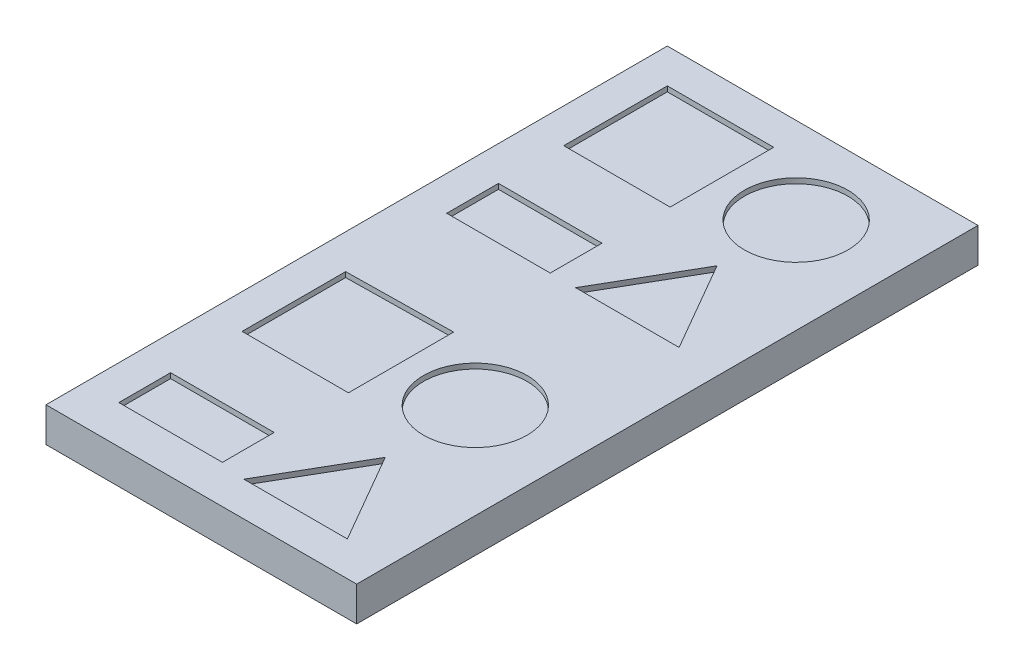
ISO-10303-21;
HEADER;
FILE_DESCRIPTION(('STEP AP214'),'2;1');
FILE_NAME('part.step','',(''),(''),'','','');
FILE_SCHEMA(('AUTOMOTIVE_DESIGN { 1 0 10303 214 1 1 1 1 }'));
ENDSEC;
DATA;
#1=APPLICATION_CONTEXT('core data for automotive mechanical design processes');
#2=APPLICATION_PROTOCOL_DEFINITION('international standard','automotive_design',2000,#1);
#3=PRODUCT_CONTEXT('',#1,'mechanical');
#4=PRODUCT('Part','Part','',(#3));
#5=PRODUCT_RELATED_PRODUCT_CATEGORY('part','',(#4));
#6=PRODUCT_DEFINITION_FORMATION('','',#4);
#7=PRODUCT_DEFINITION_CONTEXT('part definition',#1,'design');
#8=PRODUCT_DEFINITION('design','',#6,#7);
#9=PRODUCT_DEFINITION_SHAPE('','',#8);
#10=(LENGTH_UNIT() NAMED_UNIT(*) SI_UNIT(.MILLI.,.METRE.));
#11=(NAMED_UNIT(*) PLANE_ANGLE_UNIT() SI_UNIT($,.RADIAN.));
#12=(NAMED_UNIT(*) SI_UNIT($,.STERADIAN.) SOLID_ANGLE_UNIT());
#13=UNCERTAINTY_MEASURE_WITH_UNIT(LENGTH_MEASURE(1.E-05),#10,'distance_accuracy_value','');
#14=(GEOMETRIC_REPRESENTATION_CONTEXT(3) GLOBAL_UNCERTAINTY_ASSIGNED_CONTEXT((#13)) GLOBAL_UNIT_ASSIGNED_CONTEXT((#10,
#11,#12)) REPRESENTATION_CONTEXT('',''));
#15=CARTESIAN_POINT('',(0.,0.,0.));
#16=DIRECTION('',(0.,0.,1.));
#17=DIRECTION('',(1.,0.,0.));
#18=AXIS2_PLACEMENT_3D('',#15,#16,#17);
#19=CARTESIAN_POINT('',(90.,-20.,-180.));
#20=DIRECTION('',(1.,0.,0.));
#21=DIRECTION('',(0.,0.,-1.));
#22=AXIS2_PLACEMENT_3D('',#19,#20,#21);
#23=PLANE('',#22);
#24=DIRECTION('',(0.,0.,-1.));
#25=VECTOR('',#24,1.);
#26=CARTESIAN_POINT('',(90.,0.,-180.));
#27=LINE('',#26,#25);
#28=CARTESIAN_POINT('',(90.,0.,180.));
#29=VERTEX_POINT('',#28);
#30=CARTESIAN_POINT('',(90.,0.,-180.));
#31=VERTEX_POINT('',#30);
#32=EDGE_CURVE('E393',#29,#31,#27,.T.);
#33=ORIENTED_EDGE('',*,*,#32,.F.);
#34=DIRECTION('',(0.,1.,0.));
#35=VECTOR('',#34,1.);
#36=CARTESIAN_POINT('',(90.,-20.,180.));
#37=LINE('',#36,#35);
#38=CARTESIAN_POINT('',(90.,-20.,180.));
#39=VERTEX_POINT('',#38);
#40=EDGE_CURVE('E11',#39,#29,#37,.T.);
#41=ORIENTED_EDGE('',*,*,#40,.F.);
#42=DIRECTION('',(0.,0.,-1.));
#43=VECTOR('',#42,1.);
#44=CARTESIAN_POINT('',(90.,-20.,-180.));
#45=LINE('',#44,#43);
#46=CARTESIAN_POINT('',(90.,-20.,-180.));
#47=VERTEX_POINT('',#46);
#48=EDGE_CURVE('E400',#39,#47,#45,.T.);
#49=ORIENTED_EDGE('',*,*,#48,.T.);
#50=DIRECTION('',(0.,1.,0.));
#51=VECTOR('',#50,1.);
#52=CARTESIAN_POINT('',(90.,-20.,-180.));
#53=LINE('',#52,#51);
#54=EDGE_CURVE('E38',#47,#31,#53,.T.);
#55=ORIENTED_EDGE('',*,*,#54,.T.);
#56=EDGE_LOOP('',(#33,#41,#49,#55));
#57=FACE_BOUND('',#56,.T.);
#58=ADVANCED_FACE('F35',(#57),#23,.T.);
#59=CARTESIAN_POINT('',(-90.,-20.,180.));
#60=DIRECTION('',(0.,0.,1.));
#61=DIRECTION('',(1.,0.,0.));
#62=AXIS2_PLACEMENT_3D('',#59,#60,#61);
#63=PLANE('',#62);
#64=DIRECTION('',(1.,0.,0.));
#65=VECTOR('',#64,1.);
#66=CARTESIAN_POINT('',(-90.,0.,180.));
#67=LINE('',#66,#65);
#68=CARTESIAN_POINT('',(-90.,0.,180.));
#69=VERTEX_POINT('',#68);
#70=EDGE_CURVE('E404',#69,#29,#67,.T.);
#71=ORIENTED_EDGE('',*,*,#70,.F.);
#72=DIRECTION('',(0.,1.,0.));
#73=VECTOR('',#72,1.);
#74=CARTESIAN_POINT('',(-90.,-20.,180.));
#75=LINE('',#74,#73);
#76=CARTESIAN_POINT('',(-90.,-20.,180.));
#77=VERTEX_POINT('',#76);
#78=EDGE_CURVE('E43',#77,#69,#75,.T.);
#79=ORIENTED_EDGE('',*,*,#78,.F.);
#80=DIRECTION('',(1.,0.,0.));
#81=VECTOR('',#80,1.);
#82=CARTESIAN_POINT('',(-90.,-20.,180.));
#83=LINE('',#82,#81);
#84=EDGE_CURVE('E410',#77,#39,#83,.T.);
#85=ORIENTED_EDGE('',*,*,#84,.T.);
#86=ORIENTED_EDGE('',*,*,#40,.T.);
#87=EDGE_LOOP('',(#71,#79,#85,#86));
#88=FACE_BOUND('',#87,.T.);
#89=ADVANCED_FACE('F436',(#88),#63,.T.);
#90=CARTESIAN_POINT('',(-90.,-20.,-180.));
#91=DIRECTION('',(-1.,0.,0.));
#92=DIRECTION('',(0.,0.,1.));
#93=AXIS2_PLACEMENT_3D('',#90,#91,#92);
#94=PLANE('',#93);
#95=DIRECTION('',(0.,0.,1.));
#96=VECTOR('',#95,1.);
#97=CARTESIAN_POINT('',(-90.,0.,-180.));
#98=LINE('',#97,#96);
#99=CARTESIAN_POINT('',(-90.,0.,-180.));
#100=VERTEX_POINT('',#99);
#101=EDGE_CURVE('E418',#100,#69,#98,.T.);
#102=ORIENTED_EDGE('',*,*,#101,.F.);
#103=DIRECTION('',(0.,1.,0.));
#104=VECTOR('',#103,1.);
#105=CARTESIAN_POINT('',(-90.,-20.,-180.));
#106=LINE('',#105,#104);
#107=CARTESIAN_POINT('',(-90.,-20.,-180.));
#108=VERTEX_POINT('',#107);
#109=EDGE_CURVE('E423',#108,#100,#106,.T.);
#110=ORIENTED_EDGE('',*,*,#109,.F.);
#111=DIRECTION('',(0.,0.,1.));
#112=VECTOR('',#111,1.);
#113=CARTESIAN_POINT('',(-90.,-20.,-180.));
#114=LINE('',#113,#112);
#115=EDGE_CURVE('E407',#108,#77,#114,.T.);
#116=ORIENTED_EDGE('',*,*,#115,.T.);
#117=ORIENTED_EDGE('',*,*,#78,.T.);
#118=EDGE_LOOP('',(#102,#110,#116,#117));
#119=FACE_BOUND('',#118,.T.);
#120=ADVANCED_FACE('F442',(#119),#94,.T.);
#121=CARTESIAN_POINT('',(-90.,-20.,-180.));
#122=DIRECTION('',(0.,0.,-1.));
#123=DIRECTION('',(-1.,0.,0.));
#124=AXIS2_PLACEMENT_3D('',#121,#122,#123);
#125=PLANE('',#124);
#126=DIRECTION('',(-1.,0.,0.));
#127=VECTOR('',#126,1.);
#128=CARTESIAN_POINT('',(-90.,0.,-180.));
#129=LINE('',#128,#127);
#130=EDGE_CURVE('E415',#31,#100,#129,.T.);
#131=ORIENTED_EDGE('',*,*,#130,.F.);
#132=ORIENTED_EDGE('',*,*,#54,.F.);
#133=DIRECTION('',(-1.,0.,0.));
#134=VECTOR('',#133,1.);
#135=CARTESIAN_POINT('',(-90.,-20.,-180.));
#136=LINE('',#135,#134);
#137=EDGE_CURVE('E403',#47,#108,#136,.T.);
#138=ORIENTED_EDGE('',*,*,#137,.T.);
#139=ORIENTED_EDGE('',*,*,#109,.T.);
#140=EDGE_LOOP('',(#131,#132,#138,#139));
#141=FACE_BOUND('',#140,.T.);
#142=ADVANCED_FACE('F431',(#141),#125,.T.);
#143=CARTESIAN_POINT('',(0.,-20.,0.));
#144=DIRECTION('',(0.,1.,0.));
#145=DIRECTION('',(0.,0.,1.));
#146=AXIS2_PLACEMENT_3D('',#143,#144,#145);
#147=PLANE('',#146);
#148=ORIENTED_EDGE('',*,*,#48,.F.);
#149=ORIENTED_EDGE('',*,*,#84,.F.);
#150=ORIENTED_EDGE('',*,*,#115,.F.);
#151=ORIENTED_EDGE('',*,*,#137,.F.);
#152=EDGE_LOOP('',(#148,#149,#150,#151));
#153=FACE_BOUND('',#152,.T.);
#154=ADVANCED_FACE('F439',(#153),#147,.F.);
#155=CARTESIAN_POINT('',(0.,0.,0.));
#156=DIRECTION('',(0.,1.,0.));
#157=DIRECTION('',(0.,0.,1.));
#158=AXIS2_PLACEMENT_3D('',#155,#156,#157);
#159=PLANE('',#158);
#160=CARTESIAN_POINT('',(34.6561708111627,0.,-130.));
#161=DIRECTION('',(0.,1.,0.));
#162=DIRECTION('',(0.,0.,1.));
#163=AXIS2_PLACEMENT_3D('',#160,#161,#162);
#164=CIRCLE('',#163,30.);
#165=CARTESIAN_POINT('',(34.6561708111627,0.,-100.));
#166=VERTEX_POINT('',#165);
#167=EDGE_CURVE('E280',#166,#166,#164,.T.);
#168=ORIENTED_EDGE('',*,*,#167,.F.);
#169=EDGE_LOOP('',(#168));
#170=FACE_BOUND('',#169,.T.);
#171=DIRECTION('',(-0.499999999999999,0.,0.866025403784439));
#172=VECTOR('',#171,1.);
#173=CARTESIAN_POINT('',(34.6561708111627,0.,-84.1237165561634));
#174=LINE('',#173,#172);
#175=CARTESIAN_POINT('',(34.6561708111627,0.,-84.1237165561634));
#176=VERTEX_POINT('',#175);
#177=CARTESIAN_POINT('',(4.65617081116275,0.,-32.162192329097));
#178=VERTEX_POINT('',#177);
#179=EDGE_CURVE('E51',#176,#178,#174,.T.);
#180=ORIENTED_EDGE('',*,*,#179,.F.);
#181=DIRECTION('',(-0.5,0.,-0.866025403784439));
#182=VECTOR('',#181,1.);
#183=CARTESIAN_POINT('',(64.6561708111627,0.,-32.1621923290971));
#184=LINE('',#183,#182);
#185=CARTESIAN_POINT('',(64.6561708111627,0.,-32.1621923290971));
#186=VERTEX_POINT('',#185);
#187=EDGE_CURVE('E288',#186,#176,#184,.T.);
#188=ORIENTED_EDGE('',*,*,#187,.F.);
#189=DIRECTION('',(1.,0.,0.));
#190=VECTOR('',#189,1.);
#191=CARTESIAN_POINT('',(4.65617081116275,0.,-32.162192329097));
#192=LINE('',#191,#190);
#193=EDGE_CURVE('E296',#178,#186,#192,.T.);
#194=ORIENTED_EDGE('',*,*,#193,.F.);
#195=EDGE_LOOP('',(#180,#188,#194));
#196=FACE_BOUND('',#195,.T.);
#197=DIRECTION('',(0.,0.,1.));
#198=VECTOR('',#197,1.);
#199=CARTESIAN_POINT('',(-70.,0.,26.3874416264153));
#200=LINE('',#199,#198);
#201=CARTESIAN_POINT('',(-70.,0.,26.3874416264153));
#202=VERTEX_POINT('',#201);
#203=CARTESIAN_POINT('',(-70.,0.,86.3874416264154));
#204=VERTEX_POINT('',#203);
#205=EDGE_CURVE('E59',#202,#204,#200,.T.);
#206=ORIENTED_EDGE('',*,*,#205,.F.);
#207=DIRECTION('',(-0.999882207760636,0.,0.0153483094742156));
#208=VECTOR('',#207,1.);
#209=CARTESIAN_POINT('',(-70.,0.,26.3874416264153));
#210=LINE('',#209,#208);
#211=CARTESIAN_POINT('',(-8.37534543890204,0.,25.4414959319083));
#212=VERTEX_POINT('',#211);
#213=EDGE_CURVE('E310',#212,#202,#210,.T.);
#214=ORIENTED_EDGE('',*,*,#213,.F.);
#215=DIRECTION('',(0.,0.,-1.));
#216=VECTOR('',#215,1.);
#217=CARTESIAN_POINT('',(-8.37534543890204,0.,25.4414959319083));
#218=LINE('',#217,#216);
#219=CARTESIAN_POINT('',(-8.37534543890203,0.,86.3874416264154));
#220=VERTEX_POINT('',#219);
#221=EDGE_CURVE('E325',#220,#212,#218,.T.);
#222=ORIENTED_EDGE('',*,*,#221,.F.);
#223=DIRECTION('',(1.,0.,0.));
#224=VECTOR('',#223,1.);
#225=CARTESIAN_POINT('',(-70.,0.,86.3874416264154));
#226=LINE('',#225,#224);
#227=EDGE_CURVE('E321',#204,#220,#226,.T.);
#228=ORIENTED_EDGE('',*,*,#227,.F.);
#229=EDGE_LOOP('',(#206,#214,#222,#228));
#230=FACE_BOUND('',#229,.T.);
#231=DIRECTION('',(0.,0.,1.));
#232=VECTOR('',#231,1.);
#233=CARTESIAN_POINT('',(-70.,0.,-32.162192329097));
#234=LINE('',#233,#232);
#235=CARTESIAN_POINT('',(-70.,0.,-62.162192329097));
#236=VERTEX_POINT('',#235);
#237=CARTESIAN_POINT('',(-70.,0.,-32.162192329097));
#238=VERTEX_POINT('',#237);
#239=EDGE_CURVE('E350',#236,#238,#234,.T.);
#240=ORIENTED_EDGE('',*,*,#239,.F.);
#241=DIRECTION('',(-1.,0.,0.));
#242=VECTOR('',#241,1.);
#243=CARTESIAN_POINT('',(-70.,0.,-62.162192329097));
#244=LINE('',#243,#242);
#245=CARTESIAN_POINT('',(-10.,0.,-62.162192329097));
#246=VERTEX_POINT('',#245);
#247=EDGE_CURVE('E340',#246,#236,#244,.T.);
#248=ORIENTED_EDGE('',*,*,#247,.F.);
#249=DIRECTION('',(0.,0.,-1.));
#250=VECTOR('',#249,1.);
#251=CARTESIAN_POINT('',(-10.,0.,-32.162192329097));
#252=LINE('',#251,#250);
#253=CARTESIAN_POINT('',(-10.,0.,-32.162192329097));
#254=VERTEX_POINT('',#253);
#255=EDGE_CURVE('E356',#254,#246,#252,.T.);
#256=ORIENTED_EDGE('',*,*,#255,.F.);
#257=DIRECTION('',(1.,0.,0.));
#258=VECTOR('',#257,1.);
#259=CARTESIAN_POINT('',(-70.,0.,-32.162192329097));
#260=LINE('',#259,#258);
#261=EDGE_CURVE('E352',#238,#254,#260,.T.);
#262=ORIENTED_EDGE('',*,*,#261,.F.);
#263=EDGE_LOOP('',(#240,#248,#256,#262));
#264=FACE_BOUND('',#263,.T.);
#265=CARTESIAN_POINT('',(34.6561708111628,0.,55.9144687791618));
#266=DIRECTION('',(0.,1.,0.));
#267=DIRECTION('',(0.,0.,1.));
#268=AXIS2_PLACEMENT_3D('',#265,#266,#267);
#269=CIRCLE('',#268,30.);
#270=CARTESIAN_POINT('',(34.6561708111628,0.,85.9144687791618));
#271=VERTEX_POINT('',#270);
#272=EDGE_CURVE('E235',#271,#271,#269,.T.);
#273=ORIENTED_EDGE('',*,*,#272,.F.);
#274=EDGE_LOOP('',(#273));
#275=FACE_BOUND('',#274,.T.);
#276=DIRECTION('',(-0.5,0.,0.866025403784438));
#277=VECTOR('',#276,1.);
#278=CARTESIAN_POINT('',(34.6561708111628,0.,108.078586506608));
#279=LINE('',#278,#277);
#280=CARTESIAN_POINT('',(34.6561708111628,0.,108.078586506608));
#281=VERTEX_POINT('',#280);
#282=CARTESIAN_POINT('',(4.65617081116277,0.,160.040110733674));
#283=VERTEX_POINT('',#282);
#284=EDGE_CURVE('E215',#281,#283,#279,.T.);
#285=ORIENTED_EDGE('',*,*,#284,.F.);
#286=DIRECTION('',(-0.5,0.,-0.866025403784439));
#287=VECTOR('',#286,1.);
#288=CARTESIAN_POINT('',(64.6561708111628,0.,160.040110733674));
#289=LINE('',#288,#287);
#290=CARTESIAN_POINT('',(64.6561708111628,0.,160.040110733674));
#291=VERTEX_POINT('',#290);
#292=EDGE_CURVE('E229',#291,#281,#289,.T.);
#293=ORIENTED_EDGE('',*,*,#292,.F.);
#294=DIRECTION('',(1.,0.,0.));
#295=VECTOR('',#294,1.);
#296=CARTESIAN_POINT('',(4.65617081116277,0.,160.040110733674));
#297=LINE('',#296,#295);
#298=EDGE_CURVE('E232',#283,#291,#297,.T.);
#299=ORIENTED_EDGE('',*,*,#298,.F.);
#300=EDGE_LOOP('',(#285,#293,#299));
#301=FACE_BOUND('',#300,.T.);
#302=DIRECTION('',(0.,0.,1.));
#303=VECTOR('',#302,1.);
#304=CARTESIAN_POINT('',(-70.,0.,157.801384824244));
#305=LINE('',#304,#303);
#306=CARTESIAN_POINT('',(-70.,0.,127.801384824244));
#307=VERTEX_POINT('',#306);
#308=CARTESIAN_POINT('',(-70.,0.,157.801384824244));
#309=VERTEX_POINT('',#308);
#310=EDGE_CURVE('E259',#307,#309,#305,.T.);
#311=ORIENTED_EDGE('',*,*,#310,.F.);
#312=DIRECTION('',(-1.,0.,0.));
#313=VECTOR('',#312,1.);
#314=CARTESIAN_POINT('',(-70.,0.,127.801384824244));
#315=LINE('',#314,#313);
#316=CARTESIAN_POINT('',(-10.,0.,127.801384824244));
#317=VERTEX_POINT('',#316);
#318=EDGE_CURVE('E249',#317,#307,#315,.T.);
#319=ORIENTED_EDGE('',*,*,#318,.F.);
#320=DIRECTION('',(0.,0.,-1.));
#321=VECTOR('',#320,1.);
#322=CARTESIAN_POINT('',(-10.,0.,157.801384824244));
#323=LINE('',#322,#321);
#324=CARTESIAN_POINT('',(-10.,0.,157.801384824244));
#325=VERTEX_POINT('',#324);
#326=EDGE_CURVE('E264',#325,#317,#323,.T.);
#327=ORIENTED_EDGE('',*,*,#326,.F.);
#328=DIRECTION('',(1.,0.,0.));
#329=VECTOR('',#328,1.);
#330=CARTESIAN_POINT('',(-70.,0.,157.801384824244));
#331=LINE('',#330,#329);
#332=EDGE_CURVE('E261',#309,#325,#331,.T.);
#333=ORIENTED_EDGE('',*,*,#332,.F.);
#334=EDGE_LOOP('',(#311,#319,#327,#333));
#335=FACE_BOUND('',#334,.T.);
#336=DIRECTION('',(0.,0.,1.));
#337=VECTOR('',#336,1.);
#338=CARTESIAN_POINT('',(-70.,0.,-160.));
#339=LINE('',#338,#337);
#340=CARTESIAN_POINT('',(-70.,0.,-160.));
#341=VERTEX_POINT('',#340);
#342=CARTESIAN_POINT('',(-70.,0.,-99.9999999999999));
#343=VERTEX_POINT('',#342);
#344=EDGE_CURVE('E279',#341,#343,#339,.T.);
#345=ORIENTED_EDGE('',*,*,#344,.F.);
#346=DIRECTION('',(-1.,0.,0.));
#347=VECTOR('',#346,1.);
#348=CARTESIAN_POINT('',(-70.,0.,-160.));
#349=LINE('',#348,#347);
#350=CARTESIAN_POINT('',(-8.37534543890203,0.,-160.));
#351=VERTEX_POINT('',#350);
#352=EDGE_CURVE('E372',#351,#341,#349,.T.);
#353=ORIENTED_EDGE('',*,*,#352,.F.);
#354=DIRECTION('',(0.,0.,-1.));
#355=VECTOR('',#354,1.);
#356=CARTESIAN_POINT('',(-8.37534543890203,0.,-160.));
#357=LINE('',#356,#355);
#358=CARTESIAN_POINT('',(-8.37534543890202,0.,-99.9999999999999));
#359=VERTEX_POINT('',#358);
#360=EDGE_CURVE('E386',#359,#351,#357,.T.);
#361=ORIENTED_EDGE('',*,*,#360,.F.);
#362=DIRECTION('',(1.,0.,0.));
#363=VECTOR('',#362,1.);
#364=CARTESIAN_POINT('',(-70.,0.,-99.9999999999999));
#365=LINE('',#364,#363);
#366=EDGE_CURVE('E383',#343,#359,#365,.T.);
#367=ORIENTED_EDGE('',*,*,#366,.F.);
#368=EDGE_LOOP('',(#345,#353,#361,#367));
#369=FACE_BOUND('',#368,.T.);
#370=ORIENTED_EDGE('',*,*,#32,.T.);
#371=ORIENTED_EDGE('',*,*,#130,.T.);
#372=ORIENTED_EDGE('',*,*,#101,.T.);
#373=ORIENTED_EDGE('',*,*,#70,.T.);
#374=EDGE_LOOP('',(#370,#371,#372,#373));
#375=FACE_BOUND('',#374,.T.);
#376=ADVANCED_FACE('F433',(#170,#196,#230,#264,#275,#301,#335,#369,#375),#159,.T.);
#377=CARTESIAN_POINT('',(-70.,-3.,-160.));
#378=DIRECTION('',(-1.,0.,0.));
#379=DIRECTION('',(0.,0.,1.));
#380=AXIS2_PLACEMENT_3D('',#377,#378,#379);
#381=PLANE('',#380);
#382=ORIENTED_EDGE('',*,*,#344,.T.);
#383=DIRECTION('',(0.,1.,0.));
#384=VECTOR('',#383,1.);
#385=CARTESIAN_POINT('',(-70.,-3.,-99.9999999999999));
#386=LINE('',#385,#384);
#387=CARTESIAN_POINT('',(-70.,-3.,-99.9999999999999));
#388=VERTEX_POINT('',#387);
#389=EDGE_CURVE('E381',#388,#343,#386,.T.);
#390=ORIENTED_EDGE('',*,*,#389,.F.);
#391=DIRECTION('',(0.,0.,1.));
#392=VECTOR('',#391,1.);
#393=CARTESIAN_POINT('',(-70.,-3.,-160.));
#394=LINE('',#393,#392);
#395=CARTESIAN_POINT('',(-70.,-3.,-160.));
#396=VERTEX_POINT('',#395);
#397=EDGE_CURVE('E368',#396,#388,#394,.T.);
#398=ORIENTED_EDGE('',*,*,#397,.F.);
#399=DIRECTION('',(0.,1.,0.));
#400=VECTOR('',#399,1.);
#401=CARTESIAN_POINT('',(-70.,-3.,-160.));
#402=LINE('',#401,#400);
#403=EDGE_CURVE('E391',#396,#341,#402,.T.);
#404=ORIENTED_EDGE('',*,*,#403,.T.);
#405=EDGE_LOOP('',(#382,#390,#398,#404));
#406=FACE_BOUND('',#405,.T.);
#407=ADVANCED_FACE('F492',(#406),#381,.F.);
#408=CARTESIAN_POINT('',(-70.,-3.,-160.));
#409=DIRECTION('',(0.,0.,-1.));
#410=DIRECTION('',(-1.,0.,0.));
#411=AXIS2_PLACEMENT_3D('',#408,#409,#410);
#412=PLANE('',#411);
#413=ORIENTED_EDGE('',*,*,#352,.T.);
#414=ORIENTED_EDGE('',*,*,#403,.F.);
#415=DIRECTION('',(-1.,0.,0.));
#416=VECTOR('',#415,1.);
#417=CARTESIAN_POINT('',(-70.,-3.,-160.));
#418=LINE('',#417,#416);
#419=CARTESIAN_POINT('',(-8.37534543890203,-3.,-160.));
#420=VERTEX_POINT('',#419);
#421=EDGE_CURVE('E378',#420,#396,#418,.T.);
#422=ORIENTED_EDGE('',*,*,#421,.F.);
#423=DIRECTION('',(0.,1.,0.));
#424=VECTOR('',#423,1.);
#425=CARTESIAN_POINT('',(-8.37534543890203,-3.,-160.));
#426=LINE('',#425,#424);
#427=EDGE_CURVE('E394',#420,#351,#426,.T.);
#428=ORIENTED_EDGE('',*,*,#427,.T.);
#429=EDGE_LOOP('',(#413,#414,#422,#428));
#430=FACE_BOUND('',#429,.T.);
#431=ADVANCED_FACE('F499',(#430),#412,.F.);
#432=CARTESIAN_POINT('',(-8.37534543890203,-3.,-160.));
#433=DIRECTION('',(1.,0.,0.));
#434=DIRECTION('',(0.,0.,-1.));
#435=AXIS2_PLACEMENT_3D('',#432,#433,#434);
#436=PLANE('',#435);
#437=ORIENTED_EDGE('',*,*,#360,.T.);
#438=ORIENTED_EDGE('',*,*,#427,.F.);
#439=DIRECTION('',(0.,0.,-1.));
#440=VECTOR('',#439,1.);
#441=CARTESIAN_POINT('',(-8.37534543890203,-3.,-160.));
#442=LINE('',#441,#440);
#443=CARTESIAN_POINT('',(-8.37534543890202,-3.,-99.9999999999999));
#444=VERTEX_POINT('',#443);
#445=EDGE_CURVE('E375',#444,#420,#442,.T.);
#446=ORIENTED_EDGE('',*,*,#445,.F.);
#447=DIRECTION('',(0.,1.,0.));
#448=VECTOR('',#447,1.);
#449=CARTESIAN_POINT('',(-8.37534543890202,-3.,-99.9999999999999));
#450=LINE('',#449,#448);
#451=EDGE_CURVE('E396',#444,#359,#450,.T.);
#452=ORIENTED_EDGE('',*,*,#451,.T.);
#453=EDGE_LOOP('',(#437,#438,#446,#452));
#454=FACE_BOUND('',#453,.T.);
#455=ADVANCED_FACE('F507',(#454),#436,.F.);
#456=CARTESIAN_POINT('',(-70.,-3.,-99.9999999999999));
#457=DIRECTION('',(0.,0.,1.));
#458=DIRECTION('',(1.,0.,0.));
#459=AXIS2_PLACEMENT_3D('',#456,#457,#458);
#460=PLANE('',#459);
#461=ORIENTED_EDGE('',*,*,#366,.T.);
#462=ORIENTED_EDGE('',*,*,#451,.F.);
#463=DIRECTION('',(1.,0.,0.));
#464=VECTOR('',#463,1.);
#465=CARTESIAN_POINT('',(-70.,-3.,-99.9999999999999));
#466=LINE('',#465,#464);
#467=EDGE_CURVE('E371',#388,#444,#466,.T.);
#468=ORIENTED_EDGE('',*,*,#467,.F.);
#469=ORIENTED_EDGE('',*,*,#389,.T.);
#470=EDGE_LOOP('',(#461,#462,#468,#469));
#471=FACE_BOUND('',#470,.T.);
#472=ADVANCED_FACE('F515',(#471),#460,.F.);
#473=CARTESIAN_POINT('',(0.,-3.,0.));
#474=DIRECTION('',(0.,1.,0.));
#475=DIRECTION('',(0.,0.,1.));
#476=AXIS2_PLACEMENT_3D('',#473,#474,#475);
#477=PLANE('',#476);
#478=ORIENTED_EDGE('',*,*,#397,.T.);
#479=ORIENTED_EDGE('',*,*,#467,.T.);
#480=ORIENTED_EDGE('',*,*,#445,.T.);
#481=ORIENTED_EDGE('',*,*,#421,.T.);
#482=EDGE_LOOP('',(#478,#479,#480,#481));
#483=FACE_BOUND('',#482,.T.);
#484=ADVANCED_FACE('F523',(#483),#477,.T.);
#485=CARTESIAN_POINT('',(-70.,-3.,157.801384824244));
#486=DIRECTION('',(-1.,0.,0.));
#487=DIRECTION('',(0.,0.,1.));
#488=AXIS2_PLACEMENT_3D('',#485,#486,#487);
#489=PLANE('',#488);
#490=ORIENTED_EDGE('',*,*,#310,.T.);
#491=DIRECTION('',(0.,1.,0.));
#492=VECTOR('',#491,1.);
#493=CARTESIAN_POINT('',(-70.,-3.,157.801384824244));
#494=LINE('',#493,#492);
#495=CARTESIAN_POINT('',(-70.,-3.,157.801384824244));
#496=VERTEX_POINT('',#495);
#497=EDGE_CURVE('E258',#496,#309,#494,.T.);
#498=ORIENTED_EDGE('',*,*,#497,.F.);
#499=DIRECTION('',(0.,0.,1.));
#500=VECTOR('',#499,1.);
#501=CARTESIAN_POINT('',(-70.,-3.,157.801384824244));
#502=LINE('',#501,#500);
#503=CARTESIAN_POINT('',(-70.,-3.,127.801384824244));
#504=VERTEX_POINT('',#503);
#505=EDGE_CURVE('E245',#504,#496,#502,.T.);
#506=ORIENTED_EDGE('',*,*,#505,.F.);
#507=DIRECTION('',(0.,1.,0.));
#508=VECTOR('',#507,1.);
#509=CARTESIAN_POINT('',(-70.,-3.,127.801384824244));
#510=LINE('',#509,#508);
#511=EDGE_CURVE('E240',#504,#307,#510,.T.);
#512=ORIENTED_EDGE('',*,*,#511,.T.);
#513=EDGE_LOOP('',(#490,#498,#506,#512));
#514=FACE_BOUND('',#513,.T.);
#515=ADVANCED_FACE('F531',(#514),#489,.F.);
#516=CARTESIAN_POINT('',(-70.,-3.,127.801384824244));
#517=DIRECTION('',(0.,0.,-1.));
#518=DIRECTION('',(-1.,0.,0.));
#519=AXIS2_PLACEMENT_3D('',#516,#517,#518);
#520=PLANE('',#519);
#521=ORIENTED_EDGE('',*,*,#318,.T.);
#522=ORIENTED_EDGE('',*,*,#511,.F.);
#523=DIRECTION('',(-1.,0.,0.));
#524=VECTOR('',#523,1.);
#525=CARTESIAN_POINT('',(-70.,-3.,127.801384824244));
#526=LINE('',#525,#524);
#527=CARTESIAN_POINT('',(-10.,-3.,127.801384824244));
#528=VERTEX_POINT('',#527);
#529=EDGE_CURVE('E255',#528,#504,#526,.T.);
#530=ORIENTED_EDGE('',*,*,#529,.F.);
#531=DIRECTION('',(0.,1.,0.));
#532=VECTOR('',#531,1.);
#533=CARTESIAN_POINT('',(-10.,-3.,127.801384824244));
#534=LINE('',#533,#532);
#535=EDGE_CURVE('E270',#528,#317,#534,.T.);
#536=ORIENTED_EDGE('',*,*,#535,.T.);
#537=EDGE_LOOP('',(#521,#522,#530,#536));
#538=FACE_BOUND('',#537,.T.);
#539=ADVANCED_FACE('F539',(#538),#520,.F.);
#540=CARTESIAN_POINT('',(-10.,-3.,157.801384824244));
#541=DIRECTION('',(1.,0.,0.));
#542=DIRECTION('',(0.,0.,-1.));
#543=AXIS2_PLACEMENT_3D('',#540,#541,#542);
#544=PLANE('',#543);
#545=ORIENTED_EDGE('',*,*,#326,.T.);
#546=ORIENTED_EDGE('',*,*,#535,.F.);
#547=DIRECTION('',(0.,0.,-1.));
#548=VECTOR('',#547,1.);
#549=CARTESIAN_POINT('',(-10.,-3.,157.801384824244));
#550=LINE('',#549,#548);
#551=CARTESIAN_POINT('',(-10.,-3.,157.801384824244));
#552=VERTEX_POINT('',#551);
#553=EDGE_CURVE('E252',#552,#528,#550,.T.);
#554=ORIENTED_EDGE('',*,*,#553,.F.);
#555=DIRECTION('',(0.,1.,0.));
#556=VECTOR('',#555,1.);
#557=CARTESIAN_POINT('',(-10.,-3.,157.801384824244));
#558=LINE('',#557,#556);
#559=EDGE_CURVE('E272',#552,#325,#558,.T.);
#560=ORIENTED_EDGE('',*,*,#559,.T.);
#561=EDGE_LOOP('',(#545,#546,#554,#560));
#562=FACE_BOUND('',#561,.T.);
#563=ADVANCED_FACE('F547',(#562),#544,.F.);
#564=CARTESIAN_POINT('',(-70.,-3.,157.801384824244));
#565=DIRECTION('',(0.,0.,1.));
#566=DIRECTION('',(1.,0.,0.));
#567=AXIS2_PLACEMENT_3D('',#564,#565,#566);
#568=PLANE('',#567);
#569=ORIENTED_EDGE('',*,*,#332,.T.);
#570=ORIENTED_EDGE('',*,*,#559,.F.);
#571=DIRECTION('',(1.,0.,0.));
#572=VECTOR('',#571,1.);
#573=CARTESIAN_POINT('',(-70.,-3.,157.801384824244));
#574=LINE('',#573,#572);
#575=EDGE_CURVE('E248',#496,#552,#574,.T.);
#576=ORIENTED_EDGE('',*,*,#575,.F.);
#577=ORIENTED_EDGE('',*,*,#497,.T.);
#578=EDGE_LOOP('',(#569,#570,#576,#577));
#579=FACE_BOUND('',#578,.T.);
#580=ADVANCED_FACE('F555',(#579),#568,.F.);
#581=CARTESIAN_POINT('',(0.,-3.,0.));
#582=DIRECTION('',(0.,-1.,0.));
#583=DIRECTION('',(0.,0.,-1.));
#584=AXIS2_PLACEMENT_3D('',#581,#582,#583);
#585=PLANE('',#584);
#586=ORIENTED_EDGE('',*,*,#505,.T.);
#587=ORIENTED_EDGE('',*,*,#575,.T.);
#588=ORIENTED_EDGE('',*,*,#553,.T.);
#589=ORIENTED_EDGE('',*,*,#529,.T.);
#590=EDGE_LOOP('',(#586,#587,#588,#589));
#591=FACE_BOUND('',#590,.T.);
#592=ADVANCED_FACE('F563',(#591),#585,.F.);
#593=CARTESIAN_POINT('',(34.6561708111628,-3.,108.078586506608));
#594=DIRECTION('',(-0.866025403784439,0.,-0.5));
#595=DIRECTION('',(-0.5,0.,0.866025403784439));
#596=AXIS2_PLACEMENT_3D('',#593,#594,#595);
#597=PLANE('',#596);
#598=ORIENTED_EDGE('',*,*,#284,.T.);
#599=DIRECTION('',(0.,1.,0.));
#600=VECTOR('',#599,1.);
#601=CARTESIAN_POINT('',(4.65617081116277,-3.,160.040110733674));
#602=LINE('',#601,#600);
#603=CARTESIAN_POINT('',(4.65617081116277,-3.,160.040110733674));
#604=VERTEX_POINT('',#603);
#605=EDGE_CURVE('E208',#604,#283,#602,.T.);
#606=ORIENTED_EDGE('',*,*,#605,.F.);
#607=DIRECTION('',(-0.5,0.,0.866025403784438));
#608=VECTOR('',#607,1.);
#609=CARTESIAN_POINT('',(34.6561708111628,-3.,108.078586506608));
#610=LINE('',#609,#608);
#611=CARTESIAN_POINT('',(34.6561708111628,-3.,108.078586506608));
#612=VERTEX_POINT('',#611);
#613=EDGE_CURVE('E212',#612,#604,#610,.T.);
#614=ORIENTED_EDGE('',*,*,#613,.F.);
#615=DIRECTION('',(0.,1.,0.));
#616=VECTOR('',#615,1.);
#617=CARTESIAN_POINT('',(34.6561708111628,-3.,108.078586506608));
#618=LINE('',#617,#616);
#619=EDGE_CURVE('E242',#612,#281,#618,.T.);
#620=ORIENTED_EDGE('',*,*,#619,.T.);
#621=EDGE_LOOP('',(#598,#606,#614,#620));
#622=FACE_BOUND('',#621,.T.);
#623=ADVANCED_FACE('F210',(#622),#597,.F.);
#624=CARTESIAN_POINT('',(64.6561708111628,-3.,160.040110733674));
#625=DIRECTION('',(0.866025403784439,0.,-0.5));
#626=DIRECTION('',(-0.5,0.,-0.866025403784439));
#627=AXIS2_PLACEMENT_3D('',#624,#625,#626);
#628=PLANE('',#627);
#629=ORIENTED_EDGE('',*,*,#292,.T.);
#630=ORIENTED_EDGE('',*,*,#619,.F.);
#631=DIRECTION('',(-0.5,0.,-0.866025403784439));
#632=VECTOR('',#631,1.);
#633=CARTESIAN_POINT('',(64.6561708111628,-3.,160.040110733674));
#634=LINE('',#633,#632);
#635=CARTESIAN_POINT('',(64.6561708111628,-3.,160.040110733674));
#636=VERTEX_POINT('',#635);
#637=EDGE_CURVE('E220',#636,#612,#634,.T.);
#638=ORIENTED_EDGE('',*,*,#637,.F.);
#639=DIRECTION('',(0.,1.,0.));
#640=VECTOR('',#639,1.);
#641=CARTESIAN_POINT('',(64.6561708111628,-3.,160.040110733674));
#642=LINE('',#641,#640);
#643=EDGE_CURVE('E219',#636,#291,#642,.T.);
#644=ORIENTED_EDGE('',*,*,#643,.T.);
#645=EDGE_LOOP('',(#629,#630,#638,#644));
#646=FACE_BOUND('',#645,.T.);
#647=ADVANCED_FACE('F578',(#646),#628,.F.);
#648=CARTESIAN_POINT('',(4.65617081116277,-3.,160.040110733674));
#649=DIRECTION('',(0.,0.,1.));
#650=DIRECTION('',(1.,0.,0.));
#651=AXIS2_PLACEMENT_3D('',#648,#649,#650);
#652=PLANE('',#651);
#653=ORIENTED_EDGE('',*,*,#298,.T.);
#654=ORIENTED_EDGE('',*,*,#643,.F.);
#655=DIRECTION('',(1.,0.,0.));
#656=VECTOR('',#655,1.);
#657=CARTESIAN_POINT('',(4.65617081116277,-3.,160.040110733674));
#658=LINE('',#657,#656);
#659=EDGE_CURVE('E223',#604,#636,#658,.T.);
#660=ORIENTED_EDGE('',*,*,#659,.F.);
#661=ORIENTED_EDGE('',*,*,#605,.T.);
#662=EDGE_LOOP('',(#653,#654,#660,#661));
#663=FACE_BOUND('',#662,.T.);
#664=ADVANCED_FACE('F224',(#663),#652,.F.);
#665=CARTESIAN_POINT('',(0.,-3.,0.));
#666=DIRECTION('',(0.,1.,0.));
#667=DIRECTION('',(0.,0.,1.));
#668=AXIS2_PLACEMENT_3D('',#665,#666,#667);
#669=PLANE('',#668);
#670=ORIENTED_EDGE('',*,*,#613,.T.);
#671=ORIENTED_EDGE('',*,*,#659,.T.);
#672=ORIENTED_EDGE('',*,*,#637,.T.);
#673=EDGE_LOOP('',(#670,#671,#672));
#674=FACE_BOUND('',#673,.T.);
#675=ADVANCED_FACE('F228',(#674),#669,.T.);
#676=CARTESIAN_POINT('',(34.6561708111628,-3.,55.9144687791618));
#677=DIRECTION('',(0.,1.,0.));
#678=DIRECTION('',(0.,0.,1.));
#679=AXIS2_PLACEMENT_3D('',#676,#677,#678);
#680=CYLINDRICAL_SURFACE('',#679,30.);
#681=CARTESIAN_POINT('',(34.6561708111628,-3.,55.9144687791618));
#682=DIRECTION('',(0.,1.,0.));
#683=DIRECTION('',(0.,0.,1.));
#684=AXIS2_PLACEMENT_3D('',#681,#682,#683);
#685=CIRCLE('',#684,30.);
#686=CARTESIAN_POINT('',(34.6561708111628,-3.,85.9144687791618));
#687=VERTEX_POINT('',#686);
#688=EDGE_CURVE('E353',#687,#687,#685,.T.);
#689=ORIENTED_EDGE('',*,*,#688,.F.);
#690=EDGE_LOOP('',(#689));
#691=FACE_BOUND('',#690,.T.);
#692=ORIENTED_EDGE('',*,*,#272,.T.);
#693=EDGE_LOOP('',(#692));
#694=FACE_BOUND('',#693,.T.);
#695=ADVANCED_FACE('F598',(#691,#694),#680,.F.);
#696=CARTESIAN_POINT('',(34.6561708111628,-3.,55.9144687791618));
#697=DIRECTION('',(0.,1.,0.));
#698=DIRECTION('',(0.,0.,1.));
#699=AXIS2_PLACEMENT_3D('',#696,#697,#698);
#700=PLANE('',#699);
#701=ORIENTED_EDGE('',*,*,#688,.T.);
#702=EDGE_LOOP('',(#701));
#703=FACE_BOUND('',#702,.T.);
#704=ADVANCED_FACE('F605',(#703),#700,.T.);
#705=CARTESIAN_POINT('',(-70.,-3.,-32.162192329097));
#706=DIRECTION('',(-1.,0.,0.));
#707=DIRECTION('',(0.,0.,1.));
#708=AXIS2_PLACEMENT_3D('',#705,#706,#707);
#709=PLANE('',#708);
#710=ORIENTED_EDGE('',*,*,#239,.T.);
#711=DIRECTION('',(0.,1.,0.));
#712=VECTOR('',#711,1.);
#713=CARTESIAN_POINT('',(-70.,-3.,-32.162192329097));
#714=LINE('',#713,#712);
#715=CARTESIAN_POINT('',(-70.,-3.,-32.162192329097));
#716=VERTEX_POINT('',#715);
#717=EDGE_CURVE('E349',#716,#238,#714,.T.);
#718=ORIENTED_EDGE('',*,*,#717,.F.);
#719=DIRECTION('',(0.,0.,1.));
#720=VECTOR('',#719,1.);
#721=CARTESIAN_POINT('',(-70.,-3.,-32.162192329097));
#722=LINE('',#721,#720);
#723=CARTESIAN_POINT('',(-70.,-3.,-62.162192329097));
#724=VERTEX_POINT('',#723);
#725=EDGE_CURVE('E336',#724,#716,#722,.T.);
#726=ORIENTED_EDGE('',*,*,#725,.F.);
#727=DIRECTION('',(0.,1.,0.));
#728=VECTOR('',#727,1.);
#729=CARTESIAN_POINT('',(-70.,-3.,-62.162192329097));
#730=LINE('',#729,#728);
#731=EDGE_CURVE('E322',#724,#236,#730,.T.);
#732=ORIENTED_EDGE('',*,*,#731,.T.);
#733=EDGE_LOOP('',(#710,#718,#726,#732));
#734=FACE_BOUND('',#733,.T.);
#735=ADVANCED_FACE('F613',(#734),#709,.F.);
#736=CARTESIAN_POINT('',(-70.,-3.,-62.162192329097));
#737=DIRECTION('',(0.,0.,-1.));
#738=DIRECTION('',(-1.,0.,0.));
#739=AXIS2_PLACEMENT_3D('',#736,#737,#738);
#740=PLANE('',#739);
#741=ORIENTED_EDGE('',*,*,#247,.T.);
#742=ORIENTED_EDGE('',*,*,#731,.F.);
#743=DIRECTION('',(-1.,0.,0.));
#744=VECTOR('',#743,1.);
#745=CARTESIAN_POINT('',(-70.,-3.,-62.162192329097));
#746=LINE('',#745,#744);
#747=CARTESIAN_POINT('',(-10.,-3.,-62.162192329097));
#748=VERTEX_POINT('',#747);
#749=EDGE_CURVE('E346',#748,#724,#746,.T.);
#750=ORIENTED_EDGE('',*,*,#749,.F.);
#751=DIRECTION('',(0.,1.,0.));
#752=VECTOR('',#751,1.);
#753=CARTESIAN_POINT('',(-10.,-3.,-62.162192329097));
#754=LINE('',#753,#752);
#755=EDGE_CURVE('E362',#748,#246,#754,.T.);
#756=ORIENTED_EDGE('',*,*,#755,.T.);
#757=EDGE_LOOP('',(#741,#742,#750,#756));
#758=FACE_BOUND('',#757,.T.);
#759=ADVANCED_FACE('F621',(#758),#740,.F.);
#760=CARTESIAN_POINT('',(-10.,-3.,-32.162192329097));
#761=DIRECTION('',(1.,0.,0.));
#762=DIRECTION('',(0.,0.,-1.));
#763=AXIS2_PLACEMENT_3D('',#760,#761,#762);
#764=PLANE('',#763);
#765=ORIENTED_EDGE('',*,*,#255,.T.);
#766=ORIENTED_EDGE('',*,*,#755,.F.);
#767=DIRECTION('',(0.,0.,-1.));
#768=VECTOR('',#767,1.);
#769=CARTESIAN_POINT('',(-10.,-3.,-32.162192329097));
#770=LINE('',#769,#768);
#771=CARTESIAN_POINT('',(-10.,-3.,-32.162192329097));
#772=VERTEX_POINT('',#771);
#773=EDGE_CURVE('E343',#772,#748,#770,.T.);
#774=ORIENTED_EDGE('',*,*,#773,.F.);
#775=DIRECTION('',(0.,1.,0.));
#776=VECTOR('',#775,1.);
#777=CARTESIAN_POINT('',(-10.,-3.,-32.162192329097));
#778=LINE('',#777,#776);
#779=EDGE_CURVE('E364',#772,#254,#778,.T.);
#780=ORIENTED_EDGE('',*,*,#779,.T.);
#781=EDGE_LOOP('',(#765,#766,#774,#780));
#782=FACE_BOUND('',#781,.T.);
#783=ADVANCED_FACE('F629',(#782),#764,.F.);
#784=CARTESIAN_POINT('',(-70.,-3.,-32.162192329097));
#785=DIRECTION('',(0.,0.,1.));
#786=DIRECTION('',(1.,0.,0.));
#787=AXIS2_PLACEMENT_3D('',#784,#785,#786);
#788=PLANE('',#787);
#789=ORIENTED_EDGE('',*,*,#261,.T.);
#790=ORIENTED_EDGE('',*,*,#779,.F.);
#791=DIRECTION('',(1.,0.,0.));
#792=VECTOR('',#791,1.);
#793=CARTESIAN_POINT('',(-70.,-3.,-32.162192329097));
#794=LINE('',#793,#792);
#795=EDGE_CURVE('E339',#716,#772,#794,.T.);
#796=ORIENTED_EDGE('',*,*,#795,.F.);
#797=ORIENTED_EDGE('',*,*,#717,.T.);
#798=EDGE_LOOP('',(#789,#790,#796,#797));
#799=FACE_BOUND('',#798,.T.);
#800=ADVANCED_FACE('F637',(#799),#788,.F.);
#801=CARTESIAN_POINT('',(0.,-3.,0.));
#802=DIRECTION('',(0.,-1.,0.));
#803=DIRECTION('',(0.,0.,-1.));
#804=AXIS2_PLACEMENT_3D('',#801,#802,#803);
#805=PLANE('',#804);
#806=ORIENTED_EDGE('',*,*,#725,.T.);
#807=ORIENTED_EDGE('',*,*,#795,.T.);
#808=ORIENTED_EDGE('',*,*,#773,.T.);
#809=ORIENTED_EDGE('',*,*,#749,.T.);
#810=EDGE_LOOP('',(#806,#807,#808,#809));
#811=FACE_BOUND('',#810,.T.);
#812=ADVANCED_FACE('F645',(#811),#805,.F.);
#813=CARTESIAN_POINT('',(-70.,-3.,26.3874416264153));
#814=DIRECTION('',(-1.,0.,0.));
#815=DIRECTION('',(0.,0.,1.));
#816=AXIS2_PLACEMENT_3D('',#813,#814,#815);
#817=PLANE('',#816);
#818=ORIENTED_EDGE('',*,*,#205,.T.);
#819=DIRECTION('',(0.,1.,0.));
#820=VECTOR('',#819,1.);
#821=CARTESIAN_POINT('',(-70.,-3.,86.3874416264154));
#822=LINE('',#821,#820);
#823=CARTESIAN_POINT('',(-70.,-3.,86.3874416264154));
#824=VERTEX_POINT('',#823);
#825=EDGE_CURVE('E319',#824,#204,#822,.T.);
#826=ORIENTED_EDGE('',*,*,#825,.F.);
#827=DIRECTION('',(0.,0.,1.));
#828=VECTOR('',#827,1.);
#829=CARTESIAN_POINT('',(-70.,-3.,26.3874416264153));
#830=LINE('',#829,#828);
#831=CARTESIAN_POINT('',(-70.,-3.,26.3874416264153));
#832=VERTEX_POINT('',#831);
#833=EDGE_CURVE('E306',#832,#824,#830,.T.);
#834=ORIENTED_EDGE('',*,*,#833,.F.);
#835=DIRECTION('',(0.,1.,0.));
#836=VECTOR('',#835,1.);
#837=CARTESIAN_POINT('',(-70.,-3.,26.3874416264153));
#838=LINE('',#837,#836);
#839=EDGE_CURVE('E297',#832,#202,#838,.T.);
#840=ORIENTED_EDGE('',*,*,#839,.T.);
#841=EDGE_LOOP('',(#818,#826,#834,#840));
#842=FACE_BOUND('',#841,.T.);
#843=ADVANCED_FACE('F653',(#842),#817,.F.);
#844=CARTESIAN_POINT('',(-70.,-3.,26.3874416264153));
#845=DIRECTION('',(-0.0153483094742156,0.,-0.999882207760636));
#846=DIRECTION('',(-0.999882207760636,0.,0.0153483094742156));
#847=AXIS2_PLACEMENT_3D('',#844,#845,#846);
#848=PLANE('',#847);
#849=ORIENTED_EDGE('',*,*,#213,.T.);
#850=ORIENTED_EDGE('',*,*,#839,.F.);
#851=DIRECTION('',(-0.999882207760636,0.,0.0153483094742156));
#852=VECTOR('',#851,1.);
#853=CARTESIAN_POINT('',(-70.,-3.,26.3874416264153));
#854=LINE('',#853,#852);
#855=CARTESIAN_POINT('',(-8.37534543890204,-3.,25.4414959319083));
#856=VERTEX_POINT('',#855);
#857=EDGE_CURVE('E316',#856,#832,#854,.T.);
#858=ORIENTED_EDGE('',*,*,#857,.F.);
#859=DIRECTION('',(0.,1.,0.));
#860=VECTOR('',#859,1.);
#861=CARTESIAN_POINT('',(-8.37534543890204,-3.,25.4414959319083));
#862=LINE('',#861,#860);
#863=EDGE_CURVE('E331',#856,#212,#862,.T.);
#864=ORIENTED_EDGE('',*,*,#863,.T.);
#865=EDGE_LOOP('',(#849,#850,#858,#864));
#866=FACE_BOUND('',#865,.T.);
#867=ADVANCED_FACE('F661',(#866),#848,.F.);
#868=CARTESIAN_POINT('',(-8.37534543890204,-3.,25.4414959319083));
#869=DIRECTION('',(1.,0.,0.));
#870=DIRECTION('',(0.,0.,-1.));
#871=AXIS2_PLACEMENT_3D('',#868,#869,#870);
#872=PLANE('',#871);
#873=ORIENTED_EDGE('',*,*,#221,.T.);
#874=ORIENTED_EDGE('',*,*,#863,.F.);
#875=DIRECTION('',(0.,0.,-1.));
#876=VECTOR('',#875,1.);
#877=CARTESIAN_POINT('',(-8.37534543890204,-3.,25.4414959319083));
#878=LINE('',#877,#876);
#879=CARTESIAN_POINT('',(-8.37534543890203,-3.,86.3874416264154));
#880=VERTEX_POINT('',#879);
#881=EDGE_CURVE('E313',#880,#856,#878,.T.);
#882=ORIENTED_EDGE('',*,*,#881,.F.);
#883=DIRECTION('',(0.,1.,0.));
#884=VECTOR('',#883,1.);
#885=CARTESIAN_POINT('',(-8.37534543890203,-3.,86.3874416264154));
#886=LINE('',#885,#884);
#887=EDGE_CURVE('E333',#880,#220,#886,.T.);
#888=ORIENTED_EDGE('',*,*,#887,.T.);
#889=EDGE_LOOP('',(#873,#874,#882,#888));
#890=FACE_BOUND('',#889,.T.);
#891=ADVANCED_FACE('F668',(#890),#872,.F.);
#892=CARTESIAN_POINT('',(-70.,-3.,86.3874416264154));
#893=DIRECTION('',(0.,0.,1.));
#894=DIRECTION('',(1.,0.,0.));
#895=AXIS2_PLACEMENT_3D('',#892,#893,#894);
#896=PLANE('',#895);
#897=ORIENTED_EDGE('',*,*,#227,.T.);
#898=ORIENTED_EDGE('',*,*,#887,.F.);
#899=DIRECTION('',(1.,0.,0.));
#900=VECTOR('',#899,1.);
#901=CARTESIAN_POINT('',(-70.,-3.,86.3874416264154));
#902=LINE('',#901,#900);
#903=EDGE_CURVE('E309',#824,#880,#902,.T.);
#904=ORIENTED_EDGE('',*,*,#903,.F.);
#905=ORIENTED_EDGE('',*,*,#825,.T.);
#906=EDGE_LOOP('',(#897,#898,#904,#905));
#907=FACE_BOUND('',#906,.T.);
#908=ADVANCED_FACE('F676',(#907),#896,.F.);
#909=CARTESIAN_POINT('',(0.,-3.,0.));
#910=DIRECTION('',(0.,1.,0.));
#911=DIRECTION('',(0.,0.,1.));
#912=AXIS2_PLACEMENT_3D('',#909,#910,#911);
#913=PLANE('',#912);
#914=ORIENTED_EDGE('',*,*,#833,.T.);
#915=ORIENTED_EDGE('',*,*,#903,.T.);
#916=ORIENTED_EDGE('',*,*,#881,.T.);
#917=ORIENTED_EDGE('',*,*,#857,.T.);
#918=EDGE_LOOP('',(#914,#915,#916,#917));
#919=FACE_BOUND('',#918,.T.);
#920=ADVANCED_FACE('F684',(#919),#913,.T.);
#921=CARTESIAN_POINT('',(34.6561708111627,-3.,-84.1237165561634));
#922=DIRECTION('',(-0.866025403784439,0.,-0.499999999999999));
#923=DIRECTION('',(-0.499999999999999,0.,0.866025403784439));
#924=AXIS2_PLACEMENT_3D('',#921,#922,#923);
#925=PLANE('',#924);
#926=ORIENTED_EDGE('',*,*,#179,.T.);
#927=DIRECTION('',(0.,1.,0.));
#928=VECTOR('',#927,1.);
#929=CARTESIAN_POINT('',(4.65617081116275,-3.,-32.162192329097));
#930=LINE('',#929,#928);
#931=CARTESIAN_POINT('',(4.65617081116275,-3.,-32.162192329097));
#932=VERTEX_POINT('',#931);
#933=EDGE_CURVE('E294',#932,#178,#930,.T.);
#934=ORIENTED_EDGE('',*,*,#933,.F.);
#935=DIRECTION('',(-0.499999999999999,0.,0.866025403784439));
#936=VECTOR('',#935,1.);
#937=CARTESIAN_POINT('',(34.6561708111627,-3.,-84.1237165561634));
#938=LINE('',#937,#936);
#939=CARTESIAN_POINT('',(34.6561708111627,-3.,-84.1237165561634));
#940=VERTEX_POINT('',#939);
#941=EDGE_CURVE('E284',#940,#932,#938,.T.);
#942=ORIENTED_EDGE('',*,*,#941,.F.);
#943=DIRECTION('',(0.,1.,0.));
#944=VECTOR('',#943,1.);
#945=CARTESIAN_POINT('',(34.6561708111627,-3.,-84.1237165561634));
#946=LINE('',#945,#944);
#947=EDGE_CURVE('E283',#940,#176,#946,.T.);
#948=ORIENTED_EDGE('',*,*,#947,.T.);
#949=EDGE_LOOP('',(#926,#934,#942,#948));
#950=FACE_BOUND('',#949,.T.);
#951=ADVANCED_FACE('F692',(#950),#925,.F.);
#952=CARTESIAN_POINT('',(64.6561708111627,-3.,-32.1621923290971));
#953=DIRECTION('',(0.866025403784439,0.,-0.5));
#954=DIRECTION('',(-0.5,0.,-0.866025403784439));
#955=AXIS2_PLACEMENT_3D('',#952,#953,#954);
#956=PLANE('',#955);
#957=ORIENTED_EDGE('',*,*,#187,.T.);
#958=ORIENTED_EDGE('',*,*,#947,.F.);
#959=DIRECTION('',(-0.5,0.,-0.866025403784439));
#960=VECTOR('',#959,1.);
#961=CARTESIAN_POINT('',(64.6561708111627,-3.,-32.1621923290971));
#962=LINE('',#961,#960);
#963=CARTESIAN_POINT('',(64.6561708111627,-3.,-32.1621923290971));
#964=VERTEX_POINT('',#963);
#965=EDGE_CURVE('E291',#964,#940,#962,.T.);
#966=ORIENTED_EDGE('',*,*,#965,.F.);
#967=DIRECTION('',(0.,1.,0.));
#968=VECTOR('',#967,1.);
#969=CARTESIAN_POINT('',(64.6561708111627,-3.,-32.1621923290971));
#970=LINE('',#969,#968);
#971=EDGE_CURVE('E303',#964,#186,#970,.T.);
#972=ORIENTED_EDGE('',*,*,#971,.T.);
#973=EDGE_LOOP('',(#957,#958,#966,#972));
#974=FACE_BOUND('',#973,.T.);
#975=ADVANCED_FACE('F700',(#974),#956,.F.);
#976=CARTESIAN_POINT('',(4.65617081116275,-3.,-32.162192329097));
#977=DIRECTION('',(0.,0.,1.));
#978=DIRECTION('',(1.,0.,0.));
#979=AXIS2_PLACEMENT_3D('',#976,#977,#978);
#980=PLANE('',#979);
#981=ORIENTED_EDGE('',*,*,#193,.T.);
#982=ORIENTED_EDGE('',*,*,#971,.F.);
#983=DIRECTION('',(1.,0.,0.));
#984=VECTOR('',#983,1.);
#985=CARTESIAN_POINT('',(4.65617081116275,-3.,-32.162192329097));
#986=LINE('',#985,#984);
#987=EDGE_CURVE('E287',#932,#964,#986,.T.);
#988=ORIENTED_EDGE('',*,*,#987,.F.);
#989=ORIENTED_EDGE('',*,*,#933,.T.);
#990=EDGE_LOOP('',(#981,#982,#988,#989));
#991=FACE_BOUND('',#990,.T.);
#992=ADVANCED_FACE('F707',(#991),#980,.F.);
#993=CARTESIAN_POINT('',(0.,-3.,0.));
#994=DIRECTION('',(0.,1.,0.));
#995=DIRECTION('',(0.,0.,1.));
#996=AXIS2_PLACEMENT_3D('',#993,#994,#995);
#997=PLANE('',#996);
#998=ORIENTED_EDGE('',*,*,#941,.T.);
#999=ORIENTED_EDGE('',*,*,#987,.T.);
#1000=ORIENTED_EDGE('',*,*,#965,.T.);
#1001=EDGE_LOOP('',(#998,#999,#1000));
#1002=FACE_BOUND('',#1001,.T.);
#1003=ADVANCED_FACE('F715',(#1002),#997,.T.);
#1004=CARTESIAN_POINT('',(34.6561708111627,-3.,-130.));
#1005=DIRECTION('',(0.,1.,0.));
#1006=DIRECTION('',(0.,0.,1.));
#1007=AXIS2_PLACEMENT_3D('',#1004,#1005,#1006);
#1008=CYLINDRICAL_SURFACE('',#1007,30.);
#1009=CARTESIAN_POINT('',(34.6561708111627,-3.,-130.));
#1010=DIRECTION('',(0.,1.,0.));
#1011=DIRECTION('',(0.,0.,1.));
#1012=AXIS2_PLACEMENT_3D('',#1009,#1010,#1011);
#1013=CIRCLE('',#1012,30.);
#1014=CARTESIAN_POINT('',(34.6561708111627,-3.,-100.));
#1015=VERTEX_POINT('',#1014);
#1016=EDGE_CURVE('E276',#1015,#1015,#1013,.T.);
#1017=ORIENTED_EDGE('',*,*,#1016,.F.);
#1018=EDGE_LOOP('',(#1017));
#1019=FACE_BOUND('',#1018,.T.);
#1020=ORIENTED_EDGE('',*,*,#167,.T.);
#1021=EDGE_LOOP('',(#1020));
#1022=FACE_BOUND('',#1021,.T.);
#1023=ADVANCED_FACE('F723',(#1019,#1022),#1008,.F.);
#1024=CARTESIAN_POINT('',(34.6561708111627,-3.,-130.));
#1025=DIRECTION('',(0.,1.,0.));
#1026=DIRECTION('',(0.,0.,1.));
#1027=AXIS2_PLACEMENT_3D('',#1024,#1025,#1026);
#1028=PLANE('',#1027);
#1029=ORIENTED_EDGE('',*,*,#1016,.T.);
#1030=EDGE_LOOP('',(#1029));
#1031=FACE_BOUND('',#1030,.T.);
#1032=ADVANCED_FACE('F731',(#1031),#1028,.T.);
#1033=CLOSED_SHELL('',(#58,#89,#120,#142,#154,#376,#407,#431,#455,#472,#484,#515,#539,#563,#580,
#592,#623,#647,#664,#675,#695,#704,#735,#759,#783,#800,#812,#843,#867,#891,#908,#920,#951,#975,
#992,#1003,#1023,#1032));
#1034=MANIFOLD_SOLID_BREP('B2',#1033);
#1035=ADVANCED_BREP_SHAPE_REPRESENTATION('',(#18,#1034),#14);
#1036=SHAPE_DEFINITION_REPRESENTATION(#9,#1035);
ENDSEC;
END-ISO-10303-21;
